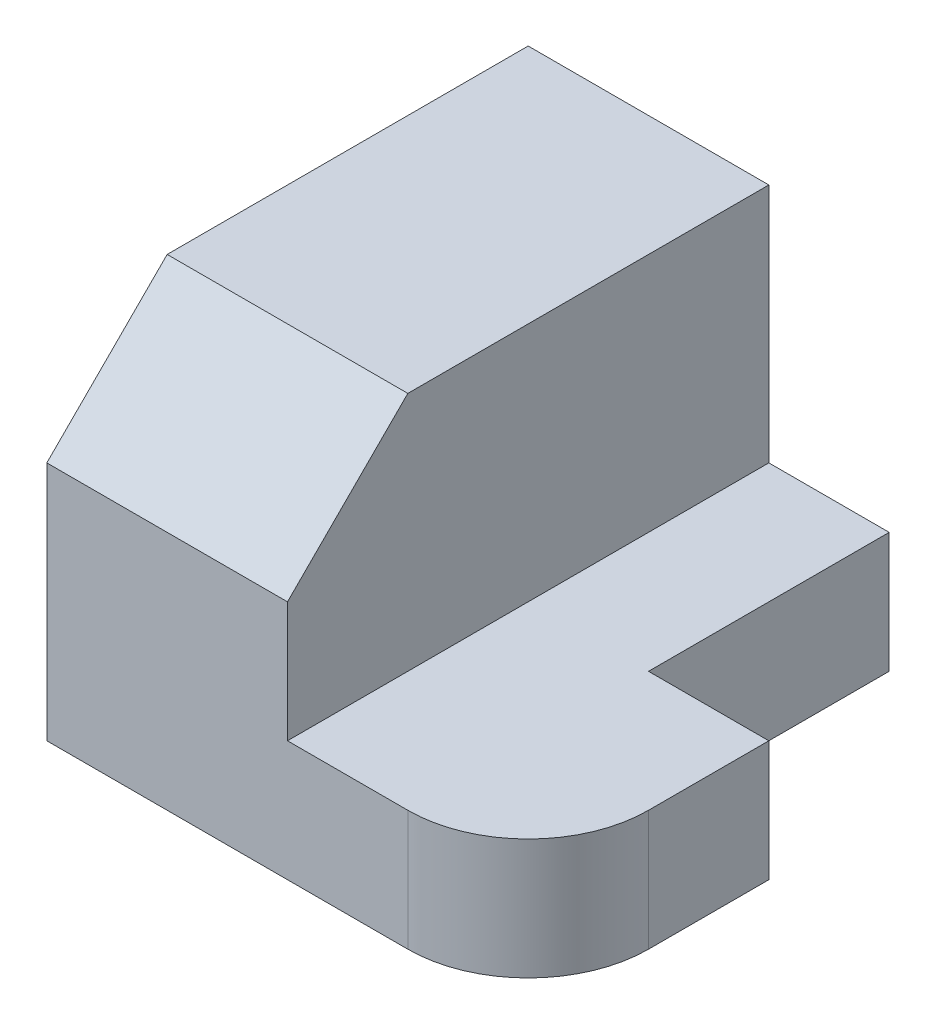
ISO-10303-21;
HEADER;
FILE_DESCRIPTION(('STEP AP214'),'2;1');
FILE_NAME('part.step','',(''),(''),'','','');
FILE_SCHEMA(('AUTOMOTIVE_DESIGN { 1 0 10303 214 1 1 1 1 }'));
ENDSEC;
DATA;
#1=APPLICATION_CONTEXT('core data for automotive mechanical design processes');
#2=APPLICATION_PROTOCOL_DEFINITION('international standard','automotive_design',2000,#1);
#3=PRODUCT_CONTEXT('',#1,'mechanical');
#4=PRODUCT('Part','Part','',(#3));
#5=PRODUCT_RELATED_PRODUCT_CATEGORY('part','',(#4));
#6=PRODUCT_DEFINITION_FORMATION('','',#4);
#7=PRODUCT_DEFINITION_CONTEXT('part definition',#1,'design');
#8=PRODUCT_DEFINITION('design','',#6,#7);
#9=PRODUCT_DEFINITION_SHAPE('','',#8);
#10=(LENGTH_UNIT() NAMED_UNIT(*) SI_UNIT(.MILLI.,.METRE.));
#11=(NAMED_UNIT(*) PLANE_ANGLE_UNIT() SI_UNIT($,.RADIAN.));
#12=(NAMED_UNIT(*) SI_UNIT($,.STERADIAN.) SOLID_ANGLE_UNIT());
#13=UNCERTAINTY_MEASURE_WITH_UNIT(LENGTH_MEASURE(1.E-05),#10,'distance_accuracy_value','');
#14=(GEOMETRIC_REPRESENTATION_CONTEXT(3) GLOBAL_UNCERTAINTY_ASSIGNED_CONTEXT((#13)) GLOBAL_UNIT_ASSIGNED_CONTEXT((#10,
#11,#12)) REPRESENTATION_CONTEXT('',''));
#15=CARTESIAN_POINT('',(0.,0.,0.));
#16=DIRECTION('',(0.,0.,1.));
#17=DIRECTION('',(1.,0.,0.));
#18=AXIS2_PLACEMENT_3D('',#15,#16,#17);
#19=CARTESIAN_POINT('',(10.,5.,5.));
#20=DIRECTION('',(0.,-1.,0.));
#21=DIRECTION('',(0.,0.,-1.));
#22=AXIS2_PLACEMENT_3D('',#19,#20,#21);
#23=CYLINDRICAL_SURFACE('',#22,5.);
#24=CARTESIAN_POINT('',(10.,0.,5.));
#25=DIRECTION('',(0.,1.,0.));
#26=DIRECTION('',(0.,0.,1.));
#27=AXIS2_PLACEMENT_3D('',#24,#25,#26);
#28=CIRCLE('',#27,5.);
#29=CARTESIAN_POINT('',(15.,0.,4.99999999999996));
#30=VERTEX_POINT('',#29);
#31=CARTESIAN_POINT('',(9.99999999999997,0.,10.));
#32=VERTEX_POINT('',#31);
#33=EDGE_CURVE('E133',#30,#32,#28,.F.);
#34=ORIENTED_EDGE('',*,*,#33,.F.);
#35=DIRECTION('',(0.,-1.,0.));
#36=VECTOR('',#35,1.);
#37=CARTESIAN_POINT('',(15.,5.,4.99999999999996));
#38=LINE('',#37,#36);
#39=CARTESIAN_POINT('',(15.,5.,4.99999999999996));
#40=VERTEX_POINT('',#39);
#41=EDGE_CURVE('E46',#40,#30,#38,.T.);
#42=ORIENTED_EDGE('',*,*,#41,.F.);
#43=CARTESIAN_POINT('',(10.,5.,5.));
#44=DIRECTION('',(0.,1.,0.));
#45=DIRECTION('',(0.,0.,1.));
#46=AXIS2_PLACEMENT_3D('',#43,#44,#45);
#47=CIRCLE('',#46,5.);
#48=CARTESIAN_POINT('',(9.99999999999997,5.,10.));
#49=VERTEX_POINT('',#48);
#50=EDGE_CURVE('E148',#40,#49,#47,.F.);
#51=ORIENTED_EDGE('',*,*,#50,.T.);
#52=DIRECTION('',(0.,-1.,0.));
#53=VECTOR('',#52,1.);
#54=CARTESIAN_POINT('',(9.99999999999997,5.,10.));
#55=LINE('',#54,#53);
#56=EDGE_CURVE('E86',#49,#32,#55,.T.);
#57=ORIENTED_EDGE('',*,*,#56,.T.);
#58=EDGE_LOOP('',(#34,#42,#51,#57));
#59=FACE_BOUND('',#58,.T.);
#60=ADVANCED_FACE('F39',(#59),#23,.T.);
#61=CARTESIAN_POINT('',(15.,5.,0.));
#62=DIRECTION('',(1.,0.,0.));
#63=DIRECTION('',(0.,0.,-1.));
#64=AXIS2_PLACEMENT_3D('',#61,#62,#63);
#65=PLANE('',#64);
#66=DIRECTION('',(0.,0.,1.));
#67=VECTOR('',#66,1.);
#68=CARTESIAN_POINT('',(15.,0.,0.));
#69=LINE('',#68,#67);
#70=CARTESIAN_POINT('',(15.,0.,0.));
#71=VERTEX_POINT('',#70);
#72=EDGE_CURVE('E136',#71,#30,#69,.T.);
#73=ORIENTED_EDGE('',*,*,#72,.F.);
#74=DIRECTION('',(0.,-1.,0.));
#75=VECTOR('',#74,1.);
#76=CARTESIAN_POINT('',(15.,5.,0.));
#77=LINE('',#76,#75);
#78=CARTESIAN_POINT('',(15.,5.,0.));
#79=VERTEX_POINT('',#78);
#80=EDGE_CURVE('E151',#79,#71,#77,.T.);
#81=ORIENTED_EDGE('',*,*,#80,.F.);
#82=DIRECTION('',(0.,0.,1.));
#83=VECTOR('',#82,1.);
#84=CARTESIAN_POINT('',(15.,5.,0.));
#85=LINE('',#84,#83);
#86=EDGE_CURVE('E156',#79,#40,#85,.T.);
#87=ORIENTED_EDGE('',*,*,#86,.T.);
#88=ORIENTED_EDGE('',*,*,#41,.T.);
#89=EDGE_LOOP('',(#73,#81,#87,#88));
#90=FACE_BOUND('',#89,.T.);
#91=ADVANCED_FACE('F155',(#90),#65,.T.);
#92=CARTESIAN_POINT('',(0.,5.,0.));
#93=DIRECTION('',(0.,0.,1.));
#94=DIRECTION('',(1.,0.,0.));
#95=AXIS2_PLACEMENT_3D('',#92,#93,#94);
#96=PLANE('',#95);
#97=DIRECTION('',(-1.,0.,0.));
#98=VECTOR('',#97,1.);
#99=CARTESIAN_POINT('',(0.,0.,0.));
#100=LINE('',#99,#98);
#101=CARTESIAN_POINT('',(10.,0.,0.));
#102=VERTEX_POINT('',#101);
#103=EDGE_CURVE('E140',#71,#102,#100,.T.);
#104=ORIENTED_EDGE('',*,*,#103,.T.);
#105=DIRECTION('',(0.,-1.,0.));
#106=VECTOR('',#105,1.);
#107=CARTESIAN_POINT('',(10.,5.,0.));
#108=LINE('',#107,#106);
#109=CARTESIAN_POINT('',(10.,5.,0.));
#110=VERTEX_POINT('',#109);
#111=EDGE_CURVE('E112',#110,#102,#108,.T.);
#112=ORIENTED_EDGE('',*,*,#111,.F.);
#113=DIRECTION('',(-1.,0.,0.));
#114=VECTOR('',#113,1.);
#115=CARTESIAN_POINT('',(0.,5.,0.));
#116=LINE('',#115,#114);
#117=EDGE_CURVE('E119',#79,#110,#116,.T.);
#118=ORIENTED_EDGE('',*,*,#117,.F.);
#119=ORIENTED_EDGE('',*,*,#80,.T.);
#120=EDGE_LOOP('',(#104,#112,#118,#119));
#121=FACE_BOUND('',#120,.T.);
#122=ADVANCED_FACE('F162',(#121),#96,.F.);
#123=CARTESIAN_POINT('',(10.,5.,0.));
#124=DIRECTION('',(1.,0.,0.));
#125=DIRECTION('',(0.,0.,-1.));
#126=AXIS2_PLACEMENT_3D('',#123,#124,#125);
#127=PLANE('',#126);
#128=DIRECTION('',(0.,0.,1.));
#129=VECTOR('',#128,1.);
#130=CARTESIAN_POINT('',(10.,0.,0.));
#131=LINE('',#130,#129);
#132=CARTESIAN_POINT('',(10.,0.,-10.));
#133=VERTEX_POINT('',#132);
#134=EDGE_CURVE('E107',#133,#102,#131,.T.);
#135=ORIENTED_EDGE('',*,*,#134,.F.);
#136=DIRECTION('',(0.,-1.,0.));
#137=VECTOR('',#136,1.);
#138=CARTESIAN_POINT('',(10.,5.,-10.));
#139=LINE('',#138,#137);
#140=CARTESIAN_POINT('',(10.,5.,-10.));
#141=VERTEX_POINT('',#140);
#142=EDGE_CURVE('E102',#141,#133,#139,.T.);
#143=ORIENTED_EDGE('',*,*,#142,.F.);
#144=DIRECTION('',(0.,0.,1.));
#145=VECTOR('',#144,1.);
#146=CARTESIAN_POINT('',(10.,5.,0.));
#147=LINE('',#146,#145);
#148=EDGE_CURVE('E105',#141,#110,#147,.T.);
#149=ORIENTED_EDGE('',*,*,#148,.T.);
#150=ORIENTED_EDGE('',*,*,#111,.T.);
#151=EDGE_LOOP('',(#135,#143,#149,#150));
#152=FACE_BOUND('',#151,.T.);
#153=ADVANCED_FACE('F104',(#152),#127,.T.);
#154=CARTESIAN_POINT('',(0.,5.,-10.));
#155=DIRECTION('',(0.,0.,-1.));
#156=DIRECTION('',(-1.,0.,0.));
#157=AXIS2_PLACEMENT_3D('',#154,#155,#156);
#158=PLANE('',#157);
#159=DIRECTION('',(1.,0.,0.));
#160=VECTOR('',#159,1.);
#161=CARTESIAN_POINT('',(0.,0.,-10.));
#162=LINE('',#161,#160);
#163=CARTESIAN_POINT('',(-5.,0.,-10.));
#164=VERTEX_POINT('',#163);
#165=EDGE_CURVE('E144',#164,#133,#162,.T.);
#166=ORIENTED_EDGE('',*,*,#165,.F.);
#167=DIRECTION('',(0.,-1.,0.));
#168=VECTOR('',#167,1.);
#169=CARTESIAN_POINT('',(-5.,15.,-10.));
#170=LINE('',#169,#168);
#171=CARTESIAN_POINT('',(-5.,15.,-10.));
#172=VERTEX_POINT('',#171);
#173=EDGE_CURVE('E171',#172,#164,#170,.T.);
#174=ORIENTED_EDGE('',*,*,#173,.F.);
#175=DIRECTION('',(-1.,0.,0.));
#176=VECTOR('',#175,1.);
#177=CARTESIAN_POINT('',(0.,15.,-10.));
#178=LINE('',#177,#176);
#179=CARTESIAN_POINT('',(5.,15.,-10.));
#180=VERTEX_POINT('',#179);
#181=EDGE_CURVE('E174',#180,#172,#178,.T.);
#182=ORIENTED_EDGE('',*,*,#181,.F.);
#183=DIRECTION('',(0.,-1.,0.));
#184=VECTOR('',#183,1.);
#185=CARTESIAN_POINT('',(5.,15.,-10.));
#186=LINE('',#185,#184);
#187=CARTESIAN_POINT('',(5.,5.,-10.));
#188=VERTEX_POINT('',#187);
#189=EDGE_CURVE('E126',#180,#188,#186,.T.);
#190=ORIENTED_EDGE('',*,*,#189,.T.);
#191=DIRECTION('',(1.,0.,0.));
#192=VECTOR('',#191,1.);
#193=CARTESIAN_POINT('',(0.,5.,-10.));
#194=LINE('',#193,#192);
#195=EDGE_CURVE('E116',#188,#141,#194,.T.);
#196=ORIENTED_EDGE('',*,*,#195,.T.);
#197=ORIENTED_EDGE('',*,*,#142,.T.);
#198=EDGE_LOOP('',(#166,#174,#182,#190,#196,#197));
#199=FACE_BOUND('',#198,.T.);
#200=ADVANCED_FACE('F123',(#199),#158,.T.);
#201=CARTESIAN_POINT('',(0.,5.,10.));
#202=DIRECTION('',(0.,0.,-1.));
#203=DIRECTION('',(-1.,0.,0.));
#204=AXIS2_PLACEMENT_3D('',#201,#202,#203);
#205=PLANE('',#204);
#206=DIRECTION('',(0.,-1.,0.));
#207=VECTOR('',#206,1.);
#208=CARTESIAN_POINT('',(5.,15.,10.));
#209=LINE('',#208,#207);
#210=CARTESIAN_POINT('',(5.,10.,10.));
#211=VERTEX_POINT('',#210);
#212=CARTESIAN_POINT('',(5.,5.,10.));
#213=VERTEX_POINT('',#212);
#214=EDGE_CURVE('E168',#211,#213,#209,.T.);
#215=ORIENTED_EDGE('',*,*,#214,.F.);
#216=DIRECTION('',(-1.,0.,0.));
#217=VECTOR('',#216,1.);
#218=CARTESIAN_POINT('',(10.,10.,10.));
#219=LINE('',#218,#217);
#220=CARTESIAN_POINT('',(-5.,10.,10.));
#221=VERTEX_POINT('',#220);
#222=EDGE_CURVE('E187',#211,#221,#219,.T.);
#223=ORIENTED_EDGE('',*,*,#222,.T.);
#224=DIRECTION('',(0.,-1.,0.));
#225=VECTOR('',#224,1.);
#226=CARTESIAN_POINT('',(-5.,15.,10.));
#227=LINE('',#226,#225);
#228=CARTESIAN_POINT('',(-5.,0.,10.));
#229=VERTEX_POINT('',#228);
#230=EDGE_CURVE('E137',#221,#229,#227,.T.);
#231=ORIENTED_EDGE('',*,*,#230,.T.);
#232=DIRECTION('',(1.,0.,0.));
#233=VECTOR('',#232,1.);
#234=CARTESIAN_POINT('',(0.,0.,10.));
#235=LINE('',#234,#233);
#236=EDGE_CURVE('E146',#229,#32,#235,.T.);
#237=ORIENTED_EDGE('',*,*,#236,.T.);
#238=ORIENTED_EDGE('',*,*,#56,.F.);
#239=DIRECTION('',(1.,0.,0.));
#240=VECTOR('',#239,1.);
#241=CARTESIAN_POINT('',(0.,5.,10.));
#242=LINE('',#241,#240);
#243=EDGE_CURVE('E61',#213,#49,#242,.T.);
#244=ORIENTED_EDGE('',*,*,#243,.F.);
#245=EDGE_LOOP('',(#215,#223,#231,#237,#238,#244));
#246=FACE_BOUND('',#245,.T.);
#247=ADVANCED_FACE('F203',(#246),#205,.F.);
#248=CARTESIAN_POINT('',(0.,5.,0.));
#249=DIRECTION('',(0.,1.,0.));
#250=DIRECTION('',(0.,0.,1.));
#251=AXIS2_PLACEMENT_3D('',#248,#249,#250);
#252=PLANE('',#251);
#253=ORIENTED_EDGE('',*,*,#50,.F.);
#254=ORIENTED_EDGE('',*,*,#86,.F.);
#255=ORIENTED_EDGE('',*,*,#117,.T.);
#256=ORIENTED_EDGE('',*,*,#148,.F.);
#257=ORIENTED_EDGE('',*,*,#195,.F.);
#258=DIRECTION('',(0.,0.,1.));
#259=VECTOR('',#258,1.);
#260=CARTESIAN_POINT('',(5.,5.,0.));
#261=LINE('',#260,#259);
#262=EDGE_CURVE('E127',#188,#213,#261,.T.);
#263=ORIENTED_EDGE('',*,*,#262,.T.);
#264=ORIENTED_EDGE('',*,*,#243,.T.);
#265=EDGE_LOOP('',(#253,#254,#255,#256,#257,#263,#264));
#266=FACE_BOUND('',#265,.T.);
#267=ADVANCED_FACE('F115',(#266),#252,.T.);
#268=CARTESIAN_POINT('',(0.,0.,0.));
#269=DIRECTION('',(0.,1.,0.));
#270=DIRECTION('',(0.,0.,1.));
#271=AXIS2_PLACEMENT_3D('',#268,#269,#270);
#272=PLANE('',#271);
#273=ORIENTED_EDGE('',*,*,#33,.T.);
#274=ORIENTED_EDGE('',*,*,#236,.F.);
#275=DIRECTION('',(0.,0.,1.));
#276=VECTOR('',#275,1.);
#277=CARTESIAN_POINT('',(-5.,0.,0.));
#278=LINE('',#277,#276);
#279=EDGE_CURVE('E175',#164,#229,#278,.T.);
#280=ORIENTED_EDGE('',*,*,#279,.F.);
#281=ORIENTED_EDGE('',*,*,#165,.T.);
#282=ORIENTED_EDGE('',*,*,#134,.T.);
#283=ORIENTED_EDGE('',*,*,#103,.F.);
#284=ORIENTED_EDGE('',*,*,#72,.T.);
#285=EDGE_LOOP('',(#273,#274,#280,#281,#282,#283,#284));
#286=FACE_BOUND('',#285,.T.);
#287=ADVANCED_FACE('F160',(#286),#272,.F.);
#288=CARTESIAN_POINT('',(5.,15.,0.));
#289=DIRECTION('',(1.,0.,0.));
#290=DIRECTION('',(0.,0.,-1.));
#291=AXIS2_PLACEMENT_3D('',#288,#289,#290);
#292=PLANE('',#291);
#293=DIRECTION('',(0.,0.707106781186548,-0.707106781186548));
#294=VECTOR('',#293,1.);
#295=CARTESIAN_POINT('',(5.,17.5,2.5));
#296=LINE('',#295,#294);
#297=CARTESIAN_POINT('',(5.,15.,5.));
#298=VERTEX_POINT('',#297);
#299=EDGE_CURVE('E52',#211,#298,#296,.T.);
#300=ORIENTED_EDGE('',*,*,#299,.F.);
#301=ORIENTED_EDGE('',*,*,#214,.T.);
#302=ORIENTED_EDGE('',*,*,#262,.F.);
#303=ORIENTED_EDGE('',*,*,#189,.F.);
#304=DIRECTION('',(0.,0.,1.));
#305=VECTOR('',#304,1.);
#306=CARTESIAN_POINT('',(5.,15.,0.));
#307=LINE('',#306,#305);
#308=EDGE_CURVE('E181',#180,#298,#307,.T.);
#309=ORIENTED_EDGE('',*,*,#308,.T.);
#310=EDGE_LOOP('',(#300,#301,#302,#303,#309));
#311=FACE_BOUND('',#310,.T.);
#312=ADVANCED_FACE('F220',(#311),#292,.T.);
#313=CARTESIAN_POINT('',(-5.,15.,0.));
#314=DIRECTION('',(1.,0.,0.));
#315=DIRECTION('',(0.,0.,-1.));
#316=AXIS2_PLACEMENT_3D('',#313,#314,#315);
#317=PLANE('',#316);
#318=ORIENTED_EDGE('',*,*,#230,.F.);
#319=DIRECTION('',(0.,-0.707106781186548,0.707106781186548));
#320=VECTOR('',#319,1.);
#321=CARTESIAN_POINT('',(-5.,15.,5.));
#322=LINE('',#321,#320);
#323=CARTESIAN_POINT('',(-5.,15.,5.));
#324=VERTEX_POINT('',#323);
#325=EDGE_CURVE('E190',#324,#221,#322,.T.);
#326=ORIENTED_EDGE('',*,*,#325,.F.);
#327=DIRECTION('',(0.,0.,1.));
#328=VECTOR('',#327,1.);
#329=CARTESIAN_POINT('',(-5.,15.,0.));
#330=LINE('',#329,#328);
#331=EDGE_CURVE('E178',#172,#324,#330,.T.);
#332=ORIENTED_EDGE('',*,*,#331,.F.);
#333=ORIENTED_EDGE('',*,*,#173,.T.);
#334=ORIENTED_EDGE('',*,*,#279,.T.);
#335=EDGE_LOOP('',(#318,#326,#332,#333,#334));
#336=FACE_BOUND('',#335,.T.);
#337=ADVANCED_FACE('F205',(#336),#317,.F.);
#338=CARTESIAN_POINT('',(0.,15.,0.));
#339=DIRECTION('',(0.,1.,0.));
#340=DIRECTION('',(0.,0.,1.));
#341=AXIS2_PLACEMENT_3D('',#338,#339,#340);
#342=PLANE('',#341);
#343=DIRECTION('',(-1.,0.,0.));
#344=VECTOR('',#343,1.);
#345=CARTESIAN_POINT('',(0.,15.,5.));
#346=LINE('',#345,#344);
#347=EDGE_CURVE('E11',#298,#324,#346,.T.);
#348=ORIENTED_EDGE('',*,*,#347,.F.);
#349=ORIENTED_EDGE('',*,*,#308,.F.);
#350=ORIENTED_EDGE('',*,*,#181,.T.);
#351=ORIENTED_EDGE('',*,*,#331,.T.);
#352=EDGE_LOOP('',(#348,#349,#350,#351));
#353=FACE_BOUND('',#352,.T.);
#354=ADVANCED_FACE('F221',(#353),#342,.T.);
#355=CARTESIAN_POINT('',(10.,15.,5.));
#356=DIRECTION('',(0.,-0.707106781186547,-0.707106781186547));
#357=DIRECTION('',(0.,0.707106781186548,-0.707106781186548));
#358=AXIS2_PLACEMENT_3D('',#355,#356,#357);
#359=PLANE('',#358);
#360=ORIENTED_EDGE('',*,*,#299,.T.);
#361=ORIENTED_EDGE('',*,*,#347,.T.);
#362=ORIENTED_EDGE('',*,*,#325,.T.);
#363=ORIENTED_EDGE('',*,*,#222,.F.);
#364=EDGE_LOOP('',(#360,#361,#362,#363));
#365=FACE_BOUND('',#364,.T.);
#366=ADVANCED_FACE('F194',(#365),#359,.F.);
#367=CLOSED_SHELL('',(#60,#91,#122,#153,#200,#247,#267,#287,#312,#337,#354,#366));
#368=MANIFOLD_SOLID_BREP('B2',#367);
#369=ADVANCED_BREP_SHAPE_REPRESENTATION('',(#18,#368),#14);
#370=SHAPE_DEFINITION_REPRESENTATION(#9,#369);
ENDSEC;
END-ISO-10303-21;
